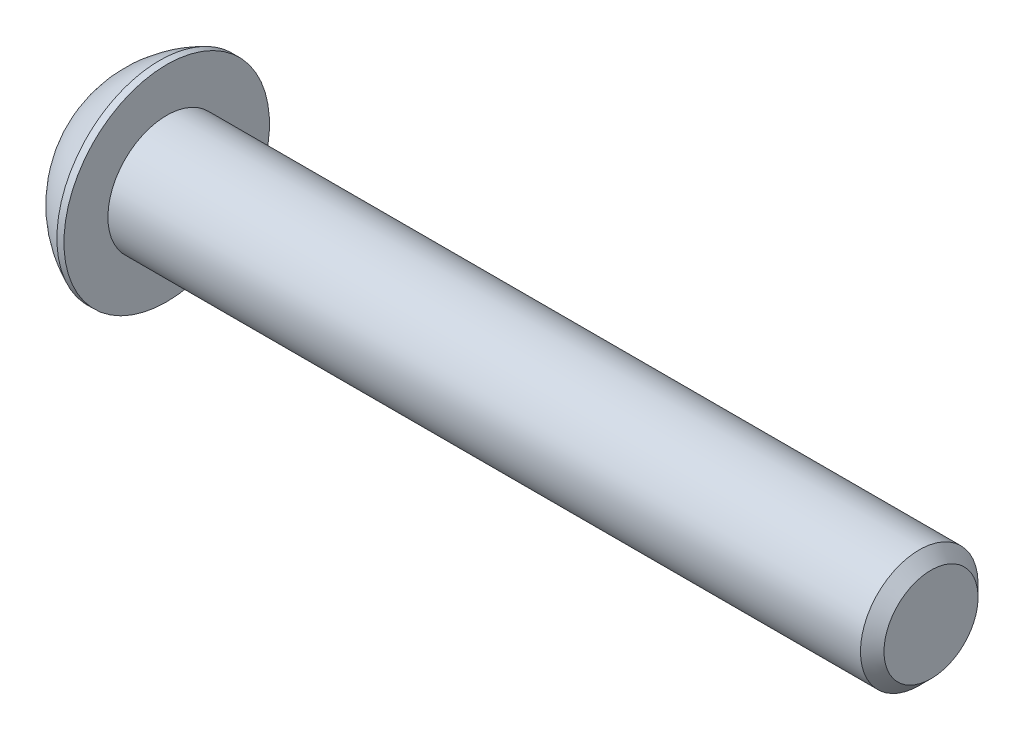
ISO-10303-21;
HEADER;
FILE_DESCRIPTION(('STEP AP214'),'2;1');
FILE_NAME('part.step','',(''),(''),'','','');
FILE_SCHEMA(('AUTOMOTIVE_DESIGN { 1 0 10303 214 1 1 1 1 }'));
ENDSEC;
DATA;
#1=APPLICATION_CONTEXT('core data for automotive mechanical design processes');
#2=APPLICATION_PROTOCOL_DEFINITION('international standard','automotive_design',2000,#1);
#3=PRODUCT_CONTEXT('',#1,'mechanical');
#4=PRODUCT('Part','Part','',(#3));
#5=PRODUCT_RELATED_PRODUCT_CATEGORY('part','',(#4));
#6=PRODUCT_DEFINITION_FORMATION('','',#4);
#7=PRODUCT_DEFINITION_CONTEXT('part definition',#1,'design');
#8=PRODUCT_DEFINITION('design','',#6,#7);
#9=PRODUCT_DEFINITION_SHAPE('','',#8);
#10=(LENGTH_UNIT() NAMED_UNIT(*) SI_UNIT(.MILLI.,.METRE.));
#11=(NAMED_UNIT(*) PLANE_ANGLE_UNIT() SI_UNIT($,.RADIAN.));
#12=(NAMED_UNIT(*) SI_UNIT($,.STERADIAN.) SOLID_ANGLE_UNIT());
#13=UNCERTAINTY_MEASURE_WITH_UNIT(LENGTH_MEASURE(1.E-05),#10,'distance_accuracy_value','');
#14=(GEOMETRIC_REPRESENTATION_CONTEXT(3) GLOBAL_UNCERTAINTY_ASSIGNED_CONTEXT((#13)) GLOBAL_UNIT_ASSIGNED_CONTEXT((#10,
#11,#12)) REPRESENTATION_CONTEXT('',''));
#15=CARTESIAN_POINT('',(0.,0.,0.));
#16=DIRECTION('',(0.,0.,1.));
#17=DIRECTION('',(1.,0.,0.));
#18=AXIS2_PLACEMENT_3D('',#15,#16,#17);
#19=CARTESIAN_POINT('',(1.32080000000268,0.,0.));
#20=DIRECTION('',(-1.,0.,0.));
#21=DIRECTION('',(0.,0.,1.));
#22=AXIS2_PLACEMENT_3D('',#19,#20,#21);
#23=CONICAL_SURFACE('',#22,1.19380000000158,1.04719755119668);
#24=CARTESIAN_POINT('',(2.01004075136213,0.,-4.44089209850063E-13));
#25=VERTEX_POINT('',#24);
#26=VERTEX_LOOP('',#25);
#27=FACE_BOUND('',#26,.T.);
#28=CARTESIAN_POINT('',(1.32080000000268,0.,0.));
#29=DIRECTION('',(-1.,0.,0.));
#30=DIRECTION('',(0.,0.,1.));
#31=AXIS2_PLACEMENT_3D('',#28,#29,#30);
#32=CIRCLE('',#31,1.19380000000158);
#33=CARTESIAN_POINT('',(1.32080000000268,0.,1.19380000000158));
#34=VERTEX_POINT('',#33);
#35=EDGE_CURVE('E20',#34,#34,#32,.T.);
#36=ORIENTED_EDGE('',*,*,#35,.T.);
#37=EDGE_LOOP('',(#36));
#38=FACE_BOUND('',#37,.T.);
#39=ADVANCED_FACE('F17',(#27,#38),#23,.F.);
#40=CARTESIAN_POINT('',(1.32080000000001,-2.29135888084638,0.));
#41=DIRECTION('',(1.,0.,0.));
#42=DIRECTION('',(0.,1.,0.));
#43=AXIS2_PLACEMENT_3D('',#40,#41,#42);
#44=PLANE('',#43);
#45=DIRECTION('',(0.,1.,0.));
#46=VECTOR('',#45,1.);
#47=CARTESIAN_POINT('',(1.32080000000001,-1.14567944042319,1.98437500000002));
#48=LINE('',#47,#46);
#49=CARTESIAN_POINT('',(1.32080000000001,1.14567944042317,1.98437500000007));
#50=VERTEX_POINT('',#49);
#51=CARTESIAN_POINT('',(1.32080000000001,-1.14567944042319,1.98437500000004));
#52=VERTEX_POINT('',#51);
#53=EDGE_CURVE('E69',#50,#52,#48,.F.);
#54=ORIENTED_EDGE('',*,*,#53,.F.);
#55=DIRECTION('',(0.,0.5,-0.866025403784439));
#56=VECTOR('',#55,1.);
#57=CARTESIAN_POINT('',(1.32080000000001,1.14567944042317,1.98437500000008));
#58=LINE('',#57,#56);
#59=CARTESIAN_POINT('',(1.32079999999979,2.29135888084634,0.));
#60=VERTEX_POINT('',#59);
#61=EDGE_CURVE('E293',#60,#50,#58,.F.);
#62=ORIENTED_EDGE('',*,*,#61,.F.);
#63=DIRECTION('',(0.,-0.5,-0.866025403784439));
#64=VECTOR('',#63,1.);
#65=CARTESIAN_POINT('',(1.32079999999957,2.29135888084633,0.));
#66=LINE('',#65,#64);
#67=CARTESIAN_POINT('',(1.3207999999999,1.14567944042317,-1.98437499999999));
#68=VERTEX_POINT('',#67);
#69=EDGE_CURVE('E297',#68,#60,#66,.F.);
#70=ORIENTED_EDGE('',*,*,#69,.F.);
#71=DIRECTION('',(0.,-1.,0.));
#72=VECTOR('',#71,1.);
#73=CARTESIAN_POINT('',(1.32080000000001,1.14567944042317,-1.984375));
#74=LINE('',#73,#72);
#75=CARTESIAN_POINT('',(1.32080000000001,-1.14567944042317,-1.98437499999998));
#76=VERTEX_POINT('',#75);
#77=EDGE_CURVE('E302',#76,#68,#74,.F.);
#78=ORIENTED_EDGE('',*,*,#77,.F.);
#79=DIRECTION('',(0.,-0.500000000000001,0.866025403784438));
#80=VECTOR('',#79,1.);
#81=CARTESIAN_POINT('',(1.32080000000001,-1.14567944042317,-1.98437499999997));
#82=LINE('',#81,#80);
#83=CARTESIAN_POINT('',(1.32080000000001,-2.29135888084637,0.));
#84=VERTEX_POINT('',#83);
#85=EDGE_CURVE('E307',#84,#76,#82,.F.);
#86=ORIENTED_EDGE('',*,*,#85,.F.);
#87=DIRECTION('',(0.,0.500000000000001,0.866025403784438));
#88=VECTOR('',#87,1.);
#89=CARTESIAN_POINT('',(1.32080000000001,-2.29135888084638,0.));
#90=LINE('',#89,#88);
#91=EDGE_CURVE('E82',#52,#84,#90,.F.);
#92=ORIENTED_EDGE('',*,*,#91,.F.);
#93=EDGE_LOOP('',(#54,#62,#70,#78,#86,#92));
#94=FACE_BOUND('',#93,.T.);
#95=ORIENTED_EDGE('',*,*,#35,.F.);
#96=EDGE_LOOP('',(#95));
#97=FACE_BOUND('',#96,.T.);
#98=ADVANCED_FACE('F75',(#94,#97),#44,.F.);
#99=CARTESIAN_POINT('',(1.32080000000001,-1.14567944042319,1.98437500000002));
#100=DIRECTION('',(0.,0.,-1.));
#101=DIRECTION('',(0.,1.,0.));
#102=AXIS2_PLACEMENT_3D('',#99,#100,#101);
#103=PLANE('',#102);
#104=ORIENTED_EDGE('',*,*,#53,.T.);
#105=DIRECTION('',(1.,0.,0.));
#106=VECTOR('',#105,1.);
#107=CARTESIAN_POINT('',(1.32080000000001,-1.14567944042321,1.98437500000002));
#108=LINE('',#107,#106);
#109=CARTESIAN_POINT('',(0.,-1.14567944042319,1.98437500000004));
#110=VERTEX_POINT('',#109);
#111=EDGE_CURVE('E79',#110,#52,#108,.T.);
#112=ORIENTED_EDGE('',*,*,#111,.F.);
#113=DIRECTION('',(0.,-1.,0.));
#114=VECTOR('',#113,1.);
#115=CARTESIAN_POINT('',(0.,0.,1.98437500000008));
#116=LINE('',#115,#114);
#117=CARTESIAN_POINT('',(0.,1.14567944042317,1.98437500000005));
#118=VERTEX_POINT('',#117);
#119=EDGE_CURVE('E287',#118,#110,#116,.T.);
#120=ORIENTED_EDGE('',*,*,#119,.F.);
#121=DIRECTION('',(1.,0.,0.));
#122=VECTOR('',#121,1.);
#123=CARTESIAN_POINT('',(1.32080000000001,1.14567944042317,1.98437500000008));
#124=LINE('',#123,#122);
#125=EDGE_CURVE('E290',#50,#118,#124,.F.);
#126=ORIENTED_EDGE('',*,*,#125,.F.);
#127=EDGE_LOOP('',(#104,#112,#120,#126));
#128=FACE_BOUND('',#127,.T.);
#129=ADVANCED_FACE('F129',(#128),#103,.T.);
#130=CARTESIAN_POINT('',(1.32080000000001,-2.29135888084638,0.));
#131=DIRECTION('',(0.,0.866025403784438,-0.500000000000001));
#132=DIRECTION('',(0.,0.500000000000001,0.866025403784438));
#133=AXIS2_PLACEMENT_3D('',#130,#131,#132);
#134=PLANE('',#133);
#135=ORIENTED_EDGE('',*,*,#91,.T.);
#136=DIRECTION('',(1.,0.,0.));
#137=VECTOR('',#136,1.);
#138=CARTESIAN_POINT('',(1.32080000000001,-2.29135888084634,0.));
#139=LINE('',#138,#137);
#140=CARTESIAN_POINT('',(0.,-2.29135888084637,0.));
#141=VERTEX_POINT('',#140);
#142=EDGE_CURVE('E309',#141,#84,#139,.T.);
#143=ORIENTED_EDGE('',*,*,#142,.F.);
#144=DIRECTION('',(0.,-0.500000000000006,-0.866025403784435));
#145=VECTOR('',#144,1.);
#146=CARTESIAN_POINT('',(0.,-1.14567944042319,1.98437500000001));
#147=LINE('',#146,#145);
#148=EDGE_CURVE('E284',#110,#141,#147,.T.);
#149=ORIENTED_EDGE('',*,*,#148,.F.);
#150=ORIENTED_EDGE('',*,*,#111,.T.);
#151=EDGE_LOOP('',(#135,#143,#149,#150));
#152=FACE_BOUND('',#151,.T.);
#153=ADVANCED_FACE('F125',(#152),#134,.T.);
#154=CARTESIAN_POINT('',(1.32080000000001,-1.14567944042317,-1.98437499999997));
#155=DIRECTION('',(0.,0.866025403784438,0.500000000000001));
#156=DIRECTION('',(0.,-0.500000000000001,0.866025403784438));
#157=AXIS2_PLACEMENT_3D('',#154,#155,#156);
#158=PLANE('',#157);
#159=ORIENTED_EDGE('',*,*,#85,.T.);
#160=DIRECTION('',(1.,0.,0.));
#161=VECTOR('',#160,1.);
#162=CARTESIAN_POINT('',(1.32079999999957,-1.14567944042317,-1.984375));
#163=LINE('',#162,#161);
#164=CARTESIAN_POINT('',(-1.1102230246258E-13,-1.14567944042317,-1.98437499999998));
#165=VERTEX_POINT('',#164);
#166=EDGE_CURVE('E304',#165,#76,#163,.T.);
#167=ORIENTED_EDGE('',*,*,#166,.F.);
#168=DIRECTION('',(0.,0.500000000000018,-0.866025403784428));
#169=VECTOR('',#168,1.);
#170=CARTESIAN_POINT('',(0.,-2.29135888084638,0.));
#171=LINE('',#170,#169);
#172=EDGE_CURVE('E281',#141,#165,#171,.T.);
#173=ORIENTED_EDGE('',*,*,#172,.F.);
#174=ORIENTED_EDGE('',*,*,#142,.T.);
#175=EDGE_LOOP('',(#159,#167,#173,#174));
#176=FACE_BOUND('',#175,.T.);
#177=ADVANCED_FACE('F121',(#176),#158,.T.);
#178=CARTESIAN_POINT('',(1.32079999999957,1.14567944042317,-1.984375));
#179=DIRECTION('',(0.,0.,1.));
#180=DIRECTION('',(0.,-1.,0.));
#181=AXIS2_PLACEMENT_3D('',#178,#179,#180);
#182=PLANE('',#181);
#183=ORIENTED_EDGE('',*,*,#77,.T.);
#184=DIRECTION('',(1.,0.,0.));
#185=VECTOR('',#184,1.);
#186=CARTESIAN_POINT('',(1.32080000000001,1.14567944042317,-1.984375));
#187=LINE('',#186,#185);
#188=CARTESIAN_POINT('',(-2.22044604925001E-13,1.14567944042317,-1.98437499999999));
#189=VERTEX_POINT('',#188);
#190=EDGE_CURVE('E299',#189,#68,#187,.T.);
#191=ORIENTED_EDGE('',*,*,#190,.F.);
#192=DIRECTION('',(0.,-1.,0.));
#193=VECTOR('',#192,1.);
#194=CARTESIAN_POINT('',(0.,0.,-1.98437499999997));
#195=LINE('',#194,#193);
#196=EDGE_CURVE('E278',#165,#189,#195,.F.);
#197=ORIENTED_EDGE('',*,*,#196,.F.);
#198=ORIENTED_EDGE('',*,*,#166,.T.);
#199=EDGE_LOOP('',(#183,#191,#197,#198));
#200=FACE_BOUND('',#199,.T.);
#201=ADVANCED_FACE('F118',(#200),#182,.T.);
#202=CARTESIAN_POINT('',(1.32080000000001,2.29135888084633,0.));
#203=DIRECTION('',(0.,-0.866025403784439,0.5));
#204=DIRECTION('',(0.,-0.5,-0.866025403784439));
#205=AXIS2_PLACEMENT_3D('',#202,#203,#204);
#206=PLANE('',#205);
#207=ORIENTED_EDGE('',*,*,#69,.T.);
#208=DIRECTION('',(1.,0.,0.));
#209=VECTOR('',#208,1.);
#210=CARTESIAN_POINT('',(1.32080000000001,2.29135888084636,0.));
#211=LINE('',#210,#209);
#212=CARTESIAN_POINT('',(0.,2.29135888084634,0.));
#213=VERTEX_POINT('',#212);
#214=EDGE_CURVE('E35',#213,#60,#211,.T.);
#215=ORIENTED_EDGE('',*,*,#214,.F.);
#216=DIRECTION('',(0.,0.499999999999999,0.866025403784439));
#217=VECTOR('',#216,1.);
#218=CARTESIAN_POINT('',(0.,1.14567944042317,-1.984375));
#219=LINE('',#218,#217);
#220=EDGE_CURVE('E275',#189,#213,#219,.T.);
#221=ORIENTED_EDGE('',*,*,#220,.F.);
#222=ORIENTED_EDGE('',*,*,#190,.T.);
#223=EDGE_LOOP('',(#207,#215,#221,#222));
#224=FACE_BOUND('',#223,.T.);
#225=ADVANCED_FACE('F114',(#224),#206,.T.);
#226=CARTESIAN_POINT('',(1.32080000000001,1.14567944042317,1.98437500000008));
#227=DIRECTION('',(0.,-0.866025403784439,-0.5));
#228=DIRECTION('',(0.,0.5,-0.866025403784439));
#229=AXIS2_PLACEMENT_3D('',#226,#227,#228);
#230=PLANE('',#229);
#231=ORIENTED_EDGE('',*,*,#61,.T.);
#232=ORIENTED_EDGE('',*,*,#125,.T.);
#233=DIRECTION('',(0.,-0.499999999999984,0.866025403784448));
#234=VECTOR('',#233,1.);
#235=CARTESIAN_POINT('',(0.,2.29135888084633,0.));
#236=LINE('',#235,#234);
#237=EDGE_CURVE('E101',#213,#118,#236,.T.);
#238=ORIENTED_EDGE('',*,*,#237,.F.);
#239=ORIENTED_EDGE('',*,*,#214,.T.);
#240=EDGE_LOOP('',(#231,#232,#238,#239));
#241=FACE_BOUND('',#240,.T.);
#242=ADVANCED_FACE('F110',(#241),#230,.T.);
#243=CARTESIAN_POINT('',(0.,0.,0.));
#244=DIRECTION('',(-1.,0.,0.));
#245=DIRECTION('',(0.,-1.,0.));
#246=AXIS2_PLACEMENT_3D('',#243,#244,#245);
#247=PLANE('',#246);
#248=ORIENTED_EDGE('',*,*,#220,.T.);
#249=ORIENTED_EDGE('',*,*,#237,.T.);
#250=ORIENTED_EDGE('',*,*,#119,.T.);
#251=ORIENTED_EDGE('',*,*,#148,.T.);
#252=ORIENTED_EDGE('',*,*,#172,.T.);
#253=ORIENTED_EDGE('',*,*,#196,.T.);
#254=EDGE_LOOP('',(#248,#249,#250,#251,#252,#253));
#255=FACE_BOUND('',#254,.T.);
#256=CARTESIAN_POINT('',(0.,2.77495,0.));
#257=CARTESIAN_POINT('',(0.,2.77494953309947,0.077911893752346));
#258=CARTESIAN_POINT('',(0.,2.77166578388025,0.15583810591977));
#259=CARTESIAN_POINT('',(0.,2.75855213600204,0.311152012455904));
#260=CARTESIAN_POINT('',(0.,2.74872030471467,0.388539541019556));
#261=CARTESIAN_POINT('',(0.,2.72255472645677,0.542341518735718));
#262=CARTESIAN_POINT('',(-2.70241452473078E-13,2.70621065843663,0.618754223567579));
#263=CARTESIAN_POINT('',(2.70461212307942E-13,2.66713326915777,0.769973634286024));
#264=CARTESIAN_POINT('',(1.00988985573598E-12,2.64439476297869,0.844778983646282));
#265=CARTESIAN_POINT('',(1.8144135030301E-12,2.5669019594335,1.06566239301792));
#266=CARTESIAN_POINT('',(4.75993428504827E-13,2.50280672569929,1.20857954243988));
#267=CARTESIAN_POINT('',(-4.76011524942789E-13,2.35149826934098,1.48160874561538));
#268=CARTESIAN_POINT('',(0.,2.26428416790396,1.61172031233499));
#269=CARTESIAN_POINT('',(0.,2.1181093928834,1.79445660654268));
#270=CARTESIAN_POINT('',(0.,2.06678693791626,1.85333128513997));
#271=CARTESIAN_POINT('',(0.,1.95940522984449,1.96650727912792));
#272=CARTESIAN_POINT('',(0.,1.90335059143535,2.02081294920044));
#273=CARTESIAN_POINT('',(0.,1.78683891013963,2.12453280878582));
#274=CARTESIAN_POINT('',(0.,1.72637988450322,2.1739447713554));
#275=CARTESIAN_POINT('',(0.,1.60151968865711,2.26750481692908));
#276=CARTESIAN_POINT('',(0.,1.53711760864537,2.31165167810847));
#277=CARTESIAN_POINT('',(0.,1.33869902291632,2.43567242603944));
#278=CARTESIAN_POINT('',(0.,1.19934704110695,2.507235886628));
#279=CARTESIAN_POINT('',(0.,0.910681609121881,2.62590828672821));
#280=CARTESIAN_POINT('',(0.,0.761368265357399,2.67301748742279));
#281=CARTESIAN_POINT('',(0.,0.456932649466624,2.74151230664007));
#282=CARTESIAN_POINT('',(0.,0.301810346322585,2.76289778778721));
#283=CARTESIAN_POINT('',(0.,-0.00982263870895204,2.77931595661155));
#284=CARTESIAN_POINT('',(0.,-0.166333320596449,2.77434864428877));
#285=CARTESIAN_POINT('',(0.,-0.476280836814452,2.73822217653073));
#286=CARTESIAN_POINT('',(0.,-0.629717687555985,2.70706316096981));
#287=CARTESIAN_POINT('',(0.,-0.929254830044275,2.61937980771149));
#288=CARTESIAN_POINT('',(0.,-1.0753550434132,2.56285519909568));
#289=CARTESIAN_POINT('',(0.,-1.28570692598579,2.46037024128109));
#290=CARTESIAN_POINT('',(0.,-1.35439130022287,2.42323494812896));
#291=CARTESIAN_POINT('',(0.,-1.488391287199,2.34331277270256));
#292=CARTESIAN_POINT('',(0.,-1.55370767631787,2.30052720108831));
#293=CARTESIAN_POINT('',(0.,-1.68047292776594,2.20962421887055));
#294=CARTESIAN_POINT('',(0.,-1.7419235278682,2.16150923122349));
#295=CARTESIAN_POINT('',(0.,-1.86060297067992,2.06024311301283));
#296=CARTESIAN_POINT('',(0.,-1.91782768181716,2.0070871669763));
#297=CARTESIAN_POINT('',(0.,-2.08239462196651,1.8407220856554));
#298=CARTESIAN_POINT('',(0.,-2.18279764272601,1.72049499758422));
#299=CARTESIAN_POINT('',(0.,-2.36195754944063,1.46487629213018));
#300=CARTESIAN_POINT('',(0.,-2.44071525816757,1.32948525142807));
#301=CARTESIAN_POINT('',(0.,-2.54098882695274,1.11796734074395));
#302=CARTESIAN_POINT('',(0.,-2.57146177392727,1.04596540008347));
#303=CARTESIAN_POINT('',(0.,-2.62621251108999,0.899689259475766));
#304=CARTESIAN_POINT('',(0.,-2.65049531495563,0.825416953360953));
#305=CARTESIAN_POINT('',(0.,-2.69267708798766,0.675215808695208));
#306=CARTESIAN_POINT('',(0.,-2.71058613777937,0.599289789313093));
#307=CARTESIAN_POINT('',(0.,-2.73994710360127,0.446213628496934));
#308=CARTESIAN_POINT('',(0.,-2.75140092413871,0.36906385502479));
#309=CARTESIAN_POINT('',(0.,-2.76470470685523,0.243162088173432));
#310=CARTESIAN_POINT('',(0.,-2.76854547596618,0.194611672428578));
#311=CARTESIAN_POINT('',(0.,-2.77366826843264,0.0973760351839819));
#312=CARTESIAN_POINT('',(0.,-2.77495029178814,0.04869081368424));
#313=CARTESIAN_POINT('',(0.,-2.77494953309947,-0.077911893752347));
#314=CARTESIAN_POINT('',(0.,-2.77166578388025,-0.155838105919771));
#315=CARTESIAN_POINT('',(0.,-2.75855213600204,-0.311152012455905));
#316=CARTESIAN_POINT('',(0.,-2.74872030471467,-0.388539541019557));
#317=CARTESIAN_POINT('',(0.,-2.72255472645677,-0.542341518735718));
#318=CARTESIAN_POINT('',(-2.70986635216127E-13,-2.70621065843663,-0.618754223567579));
#319=CARTESIAN_POINT('',(2.71207001030301E-13,-2.66713326915777,-0.769973634286023));
#320=CARTESIAN_POINT('',(1.01268841933287E-12,-2.64439476297869,-0.844778983646282));
#321=CARTESIAN_POINT('',(1.81922151867068E-12,-2.56690195943351,-1.06566239301792));
#322=CARTESIAN_POINT('',(4.76638764609873E-13,-2.50280672569929,-1.20857954243988));
#323=CARTESIAN_POINT('',(-4.76656885584179E-13,-2.35149826934097,-1.48160874561538));
#324=CARTESIAN_POINT('',(0.,-2.26428416790396,-1.61172031233499));
#325=CARTESIAN_POINT('',(0.,-2.1181093928834,-1.79445660654268));
#326=CARTESIAN_POINT('',(0.,-2.06678693791627,-1.85333128513996));
#327=CARTESIAN_POINT('',(0.,-1.95940522984449,-1.96650727912792));
#328=CARTESIAN_POINT('',(0.,-1.90335059143535,-2.02081294920044));
#329=CARTESIAN_POINT('',(0.,-1.78683891013963,-2.12453280878582));
#330=CARTESIAN_POINT('',(0.,-1.72637988450322,-2.1739447713554));
#331=CARTESIAN_POINT('',(0.,-1.60151968865711,-2.26750481692908));
#332=CARTESIAN_POINT('',(0.,-1.53711760864537,-2.31165167810847));
#333=CARTESIAN_POINT('',(0.,-1.33869902291632,-2.43567242603944));
#334=CARTESIAN_POINT('',(0.,-1.19934704110695,-2.507235886628));
#335=CARTESIAN_POINT('',(0.,-0.910681609121881,-2.62590828672821));
#336=CARTESIAN_POINT('',(0.,-0.761368265357398,-2.67301748742278));
#337=CARTESIAN_POINT('',(0.,-0.456932649466622,-2.74151230664007));
#338=CARTESIAN_POINT('',(0.,-0.301810346322583,-2.76289778778721));
#339=CARTESIAN_POINT('',(0.,0.0098226387089522,-2.77931595661156));
#340=CARTESIAN_POINT('',(0.,0.166333320596449,-2.77434864428877));
#341=CARTESIAN_POINT('',(0.,0.476280836814452,-2.73822217653073));
#342=CARTESIAN_POINT('',(0.,0.629717687555984,-2.70706316096981));
#343=CARTESIAN_POINT('',(0.,0.929254830044274,-2.61937980771149));
#344=CARTESIAN_POINT('',(0.,1.0753550434132,-2.56285519909569));
#345=CARTESIAN_POINT('',(0.,1.28570692598579,-2.46037024128109));
#346=CARTESIAN_POINT('',(0.,1.35439130022286,-2.42323494812896));
#347=CARTESIAN_POINT('',(0.,1.48839128719899,-2.34331277270256));
#348=CARTESIAN_POINT('',(0.,1.55370767631787,-2.30052720108831));
#349=CARTESIAN_POINT('',(0.,1.68047292776594,-2.20962421887055));
#350=CARTESIAN_POINT('',(0.,1.7419235278682,-2.16150923122349));
#351=CARTESIAN_POINT('',(0.,1.86060297067992,-2.06024311301283));
#352=CARTESIAN_POINT('',(0.,1.91782768181716,-2.0070871669763));
#353=CARTESIAN_POINT('',(0.,2.08239462196651,-1.8407220856554));
#354=CARTESIAN_POINT('',(0.,2.18279764272601,-1.72049499758422));
#355=CARTESIAN_POINT('',(0.,2.36195754944063,-1.46487629213018));
#356=CARTESIAN_POINT('',(0.,2.44071525816757,-1.32948525142807));
#357=CARTESIAN_POINT('',(0.,2.54098882695273,-1.11796734074395));
#358=CARTESIAN_POINT('',(0.,2.57146177392727,-1.04596540008347));
#359=CARTESIAN_POINT('',(0.,2.62621251108999,-0.899689259475766));
#360=CARTESIAN_POINT('',(0.,2.65049531495563,-0.825416953360953));
#361=CARTESIAN_POINT('',(0.,2.69267708798767,-0.675215808695208));
#362=CARTESIAN_POINT('',(0.,2.71058613777937,-0.599289789313092));
#363=CARTESIAN_POINT('',(0.,2.73994710360127,-0.446213628496933));
#364=CARTESIAN_POINT('',(0.,2.75140092413871,-0.369063855024789));
#365=CARTESIAN_POINT('',(0.,2.76470470685523,-0.243162088173432));
#366=CARTESIAN_POINT('',(0.,2.76854547596618,-0.194611672428578));
#367=CARTESIAN_POINT('',(0.,2.77366826843264,-0.0973760351839827));
#368=CARTESIAN_POINT('',(0.,2.77495029178814,-0.048690813684241));
#369=CARTESIAN_POINT('',(0.,2.77495,0.));
#370=B_SPLINE_CURVE_WITH_KNOTS('',3,(#256,#257,#258,#259,#260,#261,#262,#263,#264,#265,#266,
#267,#268,#269,#270,#271,#272,#273,#274,#275,#276,#277,#278,#279,#280,#281,#282,#283,#284,#285,
#286,#287,#288,#289,#290,#291,#292,#293,#294,#295,#296,#297,#298,#299,#300,#301,#302,#303,#304,
#305,#306,#307,#308,#309,#310,#311,#312,#313,#314,#315,#316,#317,#318,#319,#320,#321,#322,#323,
#324,#325,#326,#327,#328,#329,#330,#331,#332,#333,#334,#335,#336,#337,#338,#339,#340,#341,#342,
#343,#344,#345,#346,#347,#348,#349,#350,#351,#352,#353,#354,#355,#356,#357,#358,#359,#360,#361,
#362,#363,#364,#365,#366,#367,#368,#369),.UNSPECIFIED.,.T.,.F.,(4,2,2,2,2,2,2,2,2,2,2,2,2,2,2,2,
2,2,2,2,2,2,2,2,2,2,2,2,2,2,2,2,2,2,2,2,2,2,2,2,2,2,2,2,2,2,2,2,2,2,2,2,2,2,2,2,4),(0.,
0.233690856748163,0.467450716578752,0.701582538521472,0.935904756015415,1.40343220467667,
1.87097742791502,2.10505636898837,2.33890962270652,2.57286880998746,2.80688218486306,
3.27442101763127,3.74195485676357,4.20949119271389,4.67702752866418,5.14456136779641,
5.61210020056468,5.84611357544033,6.08007276272136,6.31392601643949,6.54800495751273,
7.01555018075072,7.48307762941212,7.71739984690652,7.95153166884955,8.18529152868023,
8.41898238542855,8.56502681353347,8.71107124163843,8.94476209838659,9.17852195821718,
9.4126537801599,9.64697599765384,10.1145034463151,10.5820486695534,10.8161276106268,
11.0499808643449,11.2839400516259,11.5179534265015,11.9854922592697,12.453026098402,
12.9205624343523,13.3880987703026,13.8556326094348,14.3231714422031,14.5571848170788,
14.7911440043598,15.0249972580779,15.2590761991512,15.7266214223891,16.1941488710506,
16.4284710885449,16.662602910488,16.8963627703186,17.130053627067,17.2760980551719,
17.4221424832769),.UNSPECIFIED.);
#371=CARTESIAN_POINT('',(0.,2.77495,0.));
#372=VERTEX_POINT('',#371);
#373=EDGE_CURVE('E94',#372,#372,#370,.T.);
#374=ORIENTED_EDGE('',*,*,#373,.F.);
#375=EDGE_LOOP('',(#374));
#376=FACE_BOUND('',#375,.T.);
#377=ADVANCED_FACE('F106',(#255,#376),#247,.T.);
#378=CARTESIAN_POINT('',(5.37260881410256,0.,0.));
#379=DIRECTION('',(0.,1.,0.));
#380=DIRECTION('',(1.,0.,0.));
#381=AXIS2_PLACEMENT_3D('',#378,#379,#380);
#382=SPHERICAL_SURFACE('',#381,6.04692260342999);
#383=CARTESIAN_POINT('',(2.97180000000002,0.,0.));
#384=DIRECTION('',(-1.,0.,0.));
#385=DIRECTION('',(0.,-1.,0.));
#386=AXIS2_PLACEMENT_3D('',#383,#384,#385);
#387=CIRCLE('',#386,5.54990000000002);
#388=CARTESIAN_POINT('',(2.97180000000002,-5.54990000000002,0.));
#389=VERTEX_POINT('',#388);
#390=EDGE_CURVE('E92',#389,#389,#387,.F.);
#391=ORIENTED_EDGE('',*,*,#390,.F.);
#392=EDGE_LOOP('',(#391));
#393=FACE_BOUND('',#392,.T.);
#394=ORIENTED_EDGE('',*,*,#373,.T.);
#395=EDGE_LOOP('',(#394));
#396=FACE_BOUND('',#395,.T.);
#397=ADVANCED_FACE('F102',(#393,#396),#382,.T.);
#398=CARTESIAN_POINT('',(44.6278,0.,1.11022302462516E-13));
#399=DIRECTION('',(-1.,0.,0.));
#400=DIRECTION('',(0.,-1.,0.));
#401=AXIS2_PLACEMENT_3D('',#398,#399,#400);
#402=PLANE('',#401);
#403=CARTESIAN_POINT('',(44.6277999999438,0.,1.11022302462516E-13));
#404=DIRECTION('',(-1.,0.,0.));
#405=DIRECTION('',(0.,0.,1.));
#406=AXIS2_PLACEMENT_3D('',#403,#404,#405);
#407=CIRCLE('',#406,2.54000000001031);
#408=CARTESIAN_POINT('',(44.6277999999438,0.,2.54000000001042));
#409=VERTEX_POINT('',#408);
#410=EDGE_CURVE('E89',#409,#409,#407,.T.);
#411=ORIENTED_EDGE('',*,*,#410,.F.);
#412=EDGE_LOOP('',(#411));
#413=FACE_BOUND('',#412,.T.);
#414=ADVANCED_FACE('F155',(#413),#402,.F.);
#415=CARTESIAN_POINT('',(0.,0.,0.));
#416=DIRECTION('',(-1.,0.,0.));
#417=DIRECTION('',(0.,-1.,0.));
#418=AXIS2_PLACEMENT_3D('',#415,#416,#417);
#419=CYLINDRICAL_SURFACE('',#418,5.54990000000002);
#420=ORIENTED_EDGE('',*,*,#390,.T.);
#421=EDGE_LOOP('',(#420));
#422=FACE_BOUND('',#421,.T.);
#423=CARTESIAN_POINT('',(3.35279999999999,0.,0.));
#424=DIRECTION('',(-1.,0.,0.));
#425=DIRECTION('',(0.,-1.,0.));
#426=AXIS2_PLACEMENT_3D('',#423,#424,#425);
#427=CIRCLE('',#426,5.54990000000002);
#428=CARTESIAN_POINT('',(3.35279999999999,-5.54990000000002,0.));
#429=VERTEX_POINT('',#428);
#430=EDGE_CURVE('E86',#429,#429,#427,.T.);
#431=ORIENTED_EDGE('',*,*,#430,.T.);
#432=EDGE_LOOP('',(#431));
#433=FACE_BOUND('',#432,.T.);
#434=ADVANCED_FACE('F152',(#422,#433),#419,.T.);
#435=CARTESIAN_POINT('',(43.9928000000691,0.,1.11022302462516E-13));
#436=DIRECTION('',(-1.,0.,0.));
#437=DIRECTION('',(0.,0.,1.));
#438=AXIS2_PLACEMENT_3D('',#435,#436,#437);
#439=CONICAL_SURFACE('',#438,3.17499999988502,0.785398163397448);
#440=CARTESIAN_POINT('',(43.9928,0.,0.));
#441=DIRECTION('',(-1.,0.,0.));
#442=DIRECTION('',(0.,-1.,0.));
#443=AXIS2_PLACEMENT_3D('',#440,#441,#442);
#444=CIRCLE('',#443,3.17500000000001);
#445=CARTESIAN_POINT('',(43.9928,-3.17500000000001,0.));
#446=VERTEX_POINT('',#445);
#447=EDGE_CURVE('E26',#446,#446,#444,.T.);
#448=ORIENTED_EDGE('',*,*,#447,.F.);
#449=EDGE_LOOP('',(#448));
#450=FACE_BOUND('',#449,.T.);
#451=ORIENTED_EDGE('',*,*,#410,.T.);
#452=EDGE_LOOP('',(#451));
#453=FACE_BOUND('',#452,.T.);
#454=ADVANCED_FACE('F145',(#450,#453),#439,.T.);
#455=CARTESIAN_POINT('',(3.35279999999955,3.17500000000001,0.));
#456=DIRECTION('',(-1.,0.,0.));
#457=DIRECTION('',(0.,-1.,0.));
#458=AXIS2_PLACEMENT_3D('',#455,#456,#457);
#459=PLANE('',#458);
#460=CARTESIAN_POINT('',(3.35279999999999,0.,0.));
#461=DIRECTION('',(-1.,0.,0.));
#462=DIRECTION('',(0.,-1.,0.));
#463=AXIS2_PLACEMENT_3D('',#460,#461,#462);
#464=CIRCLE('',#463,3.17500000000001);
#465=CARTESIAN_POINT('',(3.35279999999999,-3.17500000000001,0.));
#466=VERTEX_POINT('',#465);
#467=EDGE_CURVE('E11',#466,#466,#464,.F.);
#468=ORIENTED_EDGE('',*,*,#467,.F.);
#469=EDGE_LOOP('',(#468));
#470=FACE_BOUND('',#469,.T.);
#471=ORIENTED_EDGE('',*,*,#430,.F.);
#472=EDGE_LOOP('',(#471));
#473=FACE_BOUND('',#472,.T.);
#474=ADVANCED_FACE('F139',(#470,#473),#459,.F.);
#475=CARTESIAN_POINT('',(0.,0.,0.));
#476=DIRECTION('',(-1.,0.,0.));
#477=DIRECTION('',(0.,-1.,0.));
#478=AXIS2_PLACEMENT_3D('',#475,#476,#477);
#479=CYLINDRICAL_SURFACE('',#478,3.17500000000001);
#480=ORIENTED_EDGE('',*,*,#467,.T.);
#481=EDGE_LOOP('',(#480));
#482=FACE_BOUND('',#481,.T.);
#483=ORIENTED_EDGE('',*,*,#447,.T.);
#484=EDGE_LOOP('',(#483));
#485=FACE_BOUND('',#484,.T.);
#486=ADVANCED_FACE('F137',(#482,#485),#479,.T.);
#487=CLOSED_SHELL('',(#39,#98,#129,#153,#177,#201,#225,#242,#377,#397,#414,#434,#454,#474,#486));
#488=MANIFOLD_SOLID_BREP('B1',#487);
#489=ADVANCED_BREP_SHAPE_REPRESENTATION('',(#18,#488),#14);
#490=SHAPE_DEFINITION_REPRESENTATION(#9,#489);
ENDSEC;
END-ISO-10303-21;
